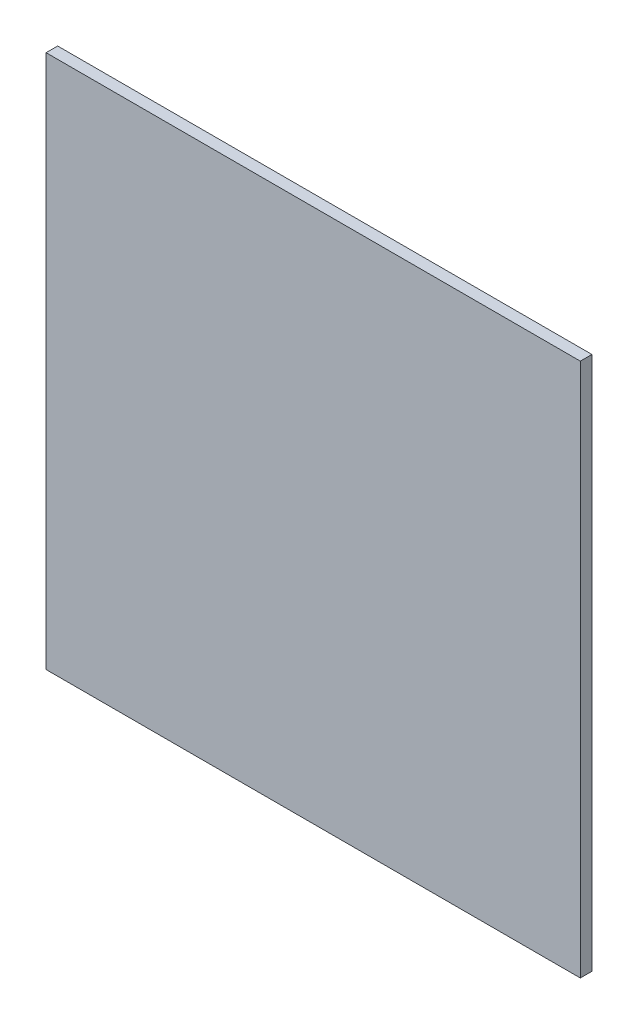
ISO-10303-21;
HEADER;
FILE_DESCRIPTION(('STEP AP214'),'2;1');
FILE_NAME('part.step','',(''),(''),'','','');
FILE_SCHEMA(('AUTOMOTIVE_DESIGN { 1 0 10303 214 1 1 1 1 }'));
ENDSEC;
DATA;
#1=APPLICATION_CONTEXT('core data for automotive mechanical design processes');
#2=APPLICATION_PROTOCOL_DEFINITION('international standard','automotive_design',2000,#1);
#3=PRODUCT_CONTEXT('',#1,'mechanical');
#4=PRODUCT('Part','Part','',(#3));
#5=PRODUCT_RELATED_PRODUCT_CATEGORY('part','',(#4));
#6=PRODUCT_DEFINITION_FORMATION('','',#4);
#7=PRODUCT_DEFINITION_CONTEXT('part definition',#1,'design');
#8=PRODUCT_DEFINITION('design','',#6,#7);
#9=PRODUCT_DEFINITION_SHAPE('','',#8);
#10=(LENGTH_UNIT() NAMED_UNIT(*) SI_UNIT(.MILLI.,.METRE.));
#11=(NAMED_UNIT(*) PLANE_ANGLE_UNIT() SI_UNIT($,.RADIAN.));
#12=(NAMED_UNIT(*) SI_UNIT($,.STERADIAN.) SOLID_ANGLE_UNIT());
#13=UNCERTAINTY_MEASURE_WITH_UNIT(LENGTH_MEASURE(1.E-05),#10,'distance_accuracy_value','');
#14=(GEOMETRIC_REPRESENTATION_CONTEXT(3) GLOBAL_UNCERTAINTY_ASSIGNED_CONTEXT((#13)) GLOBAL_UNIT_ASSIGNED_CONTEXT((#10,
#11,#12)) REPRESENTATION_CONTEXT('',''));
#15=CARTESIAN_POINT('',(0.,0.,0.));
#16=DIRECTION('',(0.,0.,1.));
#17=DIRECTION('',(1.,0.,0.));
#18=AXIS2_PLACEMENT_3D('',#15,#16,#17);
#19=CARTESIAN_POINT('',(-2.07499966,2.0750022,0.08999982));
#20=DIRECTION('',(0.,0.,1.));
#21=DIRECTION('',(1.,0.,0.));
#22=AXIS2_PLACEMENT_3D('',#19,#20,#21);
#23=PLANE('',#22);
#24=DIRECTION('',(0.,1.,0.));
#25=VECTOR('',#24,1.);
#26=CARTESIAN_POINT('',(2.0750022,2.0750022,0.08999982));
#27=LINE('',#26,#25);
#28=CARTESIAN_POINT('',(2.0750022,2.0750022,0.08999982));
#29=VERTEX_POINT('',#28);
#30=CARTESIAN_POINT('',(2.0750022,-2.07499966,0.08999982));
#31=VERTEX_POINT('',#30);
#32=EDGE_CURVE('E52',#29,#31,#27,.F.);
#33=ORIENTED_EDGE('',*,*,#32,.F.);
#34=DIRECTION('',(1.,0.,0.));
#35=VECTOR('',#34,1.);
#36=CARTESIAN_POINT('',(-2.07499966,2.0750022,0.08999982));
#37=LINE('',#36,#35);
#38=CARTESIAN_POINT('',(-2.07499966,2.0750022,0.08999982));
#39=VERTEX_POINT('',#38);
#40=EDGE_CURVE('E67',#39,#29,#37,.T.);
#41=ORIENTED_EDGE('',*,*,#40,.F.);
#42=DIRECTION('',(0.,1.,0.));
#43=VECTOR('',#42,1.);
#44=CARTESIAN_POINT('',(-2.07499966,-2.07499966,0.08999982));
#45=LINE('',#44,#43);
#46=CARTESIAN_POINT('',(-2.07499966,-2.07499966,0.08999982));
#47=VERTEX_POINT('',#46);
#48=EDGE_CURVE('E19',#47,#39,#45,.T.);
#49=ORIENTED_EDGE('',*,*,#48,.F.);
#50=DIRECTION('',(1.,0.,0.));
#51=VECTOR('',#50,1.);
#52=CARTESIAN_POINT('',(2.0750022,-2.07499966,0.08999982));
#53=LINE('',#52,#51);
#54=EDGE_CURVE('E57',#31,#47,#53,.F.);
#55=ORIENTED_EDGE('',*,*,#54,.F.);
#56=EDGE_LOOP('',(#33,#41,#49,#55));
#57=FACE_BOUND('',#56,.T.);
#58=ADVANCED_FACE('F16',(#57),#23,.T.);
#59=CARTESIAN_POINT('',(-2.07499966,-2.07499966,0.));
#60=DIRECTION('',(-1.,0.,0.));
#61=DIRECTION('',(0.,0.,1.));
#62=AXIS2_PLACEMENT_3D('',#59,#60,#61);
#63=PLANE('',#62);
#64=DIRECTION('',(0.,0.,1.));
#65=VECTOR('',#64,1.);
#66=CARTESIAN_POINT('',(-2.07499966,2.0750022,0.));
#67=LINE('',#66,#65);
#68=CARTESIAN_POINT('',(-2.07499966,2.0750022,0.));
#69=VERTEX_POINT('',#68);
#70=EDGE_CURVE('E78',#69,#39,#67,.T.);
#71=ORIENTED_EDGE('',*,*,#70,.F.);
#72=DIRECTION('',(0.,1.,0.));
#73=VECTOR('',#72,1.);
#74=CARTESIAN_POINT('',(-2.07499966,2.0750022,0.));
#75=LINE('',#74,#73);
#76=CARTESIAN_POINT('',(-2.07499966,-2.07499966,0.));
#77=VERTEX_POINT('',#76);
#78=EDGE_CURVE('E73',#69,#77,#75,.F.);
#79=ORIENTED_EDGE('',*,*,#78,.T.);
#80=DIRECTION('',(0.,0.,-1.));
#81=VECTOR('',#80,1.);
#82=CARTESIAN_POINT('',(-2.07499966,-2.07499966,0.));
#83=LINE('',#82,#81);
#84=EDGE_CURVE('E62',#47,#77,#83,.T.);
#85=ORIENTED_EDGE('',*,*,#84,.F.);
#86=ORIENTED_EDGE('',*,*,#48,.T.);
#87=EDGE_LOOP('',(#71,#79,#85,#86));
#88=FACE_BOUND('',#87,.T.);
#89=ADVANCED_FACE('F72',(#88),#63,.T.);
#90=CARTESIAN_POINT('',(2.0750022,-2.07499966,0.));
#91=DIRECTION('',(0.,-1.,0.));
#92=DIRECTION('',(0.,0.,-1.));
#93=AXIS2_PLACEMENT_3D('',#90,#91,#92);
#94=PLANE('',#93);
#95=ORIENTED_EDGE('',*,*,#84,.T.);
#96=DIRECTION('',(1.,0.,0.));
#97=VECTOR('',#96,1.);
#98=CARTESIAN_POINT('',(-2.07499966,-2.07499966,0.));
#99=LINE('',#98,#97);
#100=CARTESIAN_POINT('',(2.0750022,-2.07499966,0.));
#101=VERTEX_POINT('',#100);
#102=EDGE_CURVE('E83',#77,#101,#99,.T.);
#103=ORIENTED_EDGE('',*,*,#102,.T.);
#104=DIRECTION('',(0.,0.,-1.));
#105=VECTOR('',#104,1.);
#106=CARTESIAN_POINT('',(2.0750022,-2.07499966,0.));
#107=LINE('',#106,#105);
#108=EDGE_CURVE('E64',#31,#101,#107,.T.);
#109=ORIENTED_EDGE('',*,*,#108,.F.);
#110=ORIENTED_EDGE('',*,*,#54,.T.);
#111=EDGE_LOOP('',(#95,#103,#109,#110));
#112=FACE_BOUND('',#111,.T.);
#113=ADVANCED_FACE('F59',(#112),#94,.T.);
#114=CARTESIAN_POINT('',(2.0750022,2.0750022,0.));
#115=DIRECTION('',(1.,0.,0.));
#116=DIRECTION('',(0.,0.,-1.));
#117=AXIS2_PLACEMENT_3D('',#114,#115,#116);
#118=PLANE('',#117);
#119=ORIENTED_EDGE('',*,*,#108,.T.);
#120=DIRECTION('',(0.,1.,0.));
#121=VECTOR('',#120,1.);
#122=CARTESIAN_POINT('',(2.0750022,2.0750022,0.));
#123=LINE('',#122,#121);
#124=CARTESIAN_POINT('',(2.0750022,2.0750022,0.));
#125=VERTEX_POINT('',#124);
#126=EDGE_CURVE('E25',#101,#125,#123,.T.);
#127=ORIENTED_EDGE('',*,*,#126,.T.);
#128=DIRECTION('',(0.,0.,1.));
#129=VECTOR('',#128,1.);
#130=CARTESIAN_POINT('',(2.0750022,2.0750022,0.));
#131=LINE('',#130,#129);
#132=EDGE_CURVE('E33',#29,#125,#131,.F.);
#133=ORIENTED_EDGE('',*,*,#132,.F.);
#134=ORIENTED_EDGE('',*,*,#32,.T.);
#135=EDGE_LOOP('',(#119,#127,#133,#134));
#136=FACE_BOUND('',#135,.T.);
#137=ADVANCED_FACE('F87',(#136),#118,.T.);
#138=CARTESIAN_POINT('',(-2.07499966,2.0750022,0.));
#139=DIRECTION('',(0.,1.,0.));
#140=DIRECTION('',(0.,0.,1.));
#141=AXIS2_PLACEMENT_3D('',#138,#139,#140);
#142=PLANE('',#141);
#143=ORIENTED_EDGE('',*,*,#132,.T.);
#144=DIRECTION('',(1.,0.,0.));
#145=VECTOR('',#144,1.);
#146=CARTESIAN_POINT('',(-2.07499966,2.0750022,0.));
#147=LINE('',#146,#145);
#148=EDGE_CURVE('E10',#125,#69,#147,.F.);
#149=ORIENTED_EDGE('',*,*,#148,.T.);
#150=ORIENTED_EDGE('',*,*,#70,.T.);
#151=ORIENTED_EDGE('',*,*,#40,.T.);
#152=EDGE_LOOP('',(#143,#149,#150,#151));
#153=FACE_BOUND('',#152,.T.);
#154=ADVANCED_FACE('F90',(#153),#142,.T.);
#155=CARTESIAN_POINT('',(-2.07499966,2.0750022,0.));
#156=DIRECTION('',(0.,0.,1.));
#157=DIRECTION('',(1.,0.,0.));
#158=AXIS2_PLACEMENT_3D('',#155,#156,#157);
#159=PLANE('',#158);
#160=ORIENTED_EDGE('',*,*,#126,.F.);
#161=ORIENTED_EDGE('',*,*,#102,.F.);
#162=ORIENTED_EDGE('',*,*,#78,.F.);
#163=ORIENTED_EDGE('',*,*,#148,.F.);
#164=EDGE_LOOP('',(#160,#161,#162,#163));
#165=FACE_BOUND('',#164,.T.);
#166=ADVANCED_FACE('F89',(#165),#159,.F.);
#167=CLOSED_SHELL('',(#58,#89,#113,#137,#154,#166));
#168=MANIFOLD_SOLID_BREP('B1',#167);
#169=ADVANCED_BREP_SHAPE_REPRESENTATION('',(#18,#168),#14);
#170=SHAPE_DEFINITION_REPRESENTATION(#9,#169);
ENDSEC;
END-ISO-10303-21;
